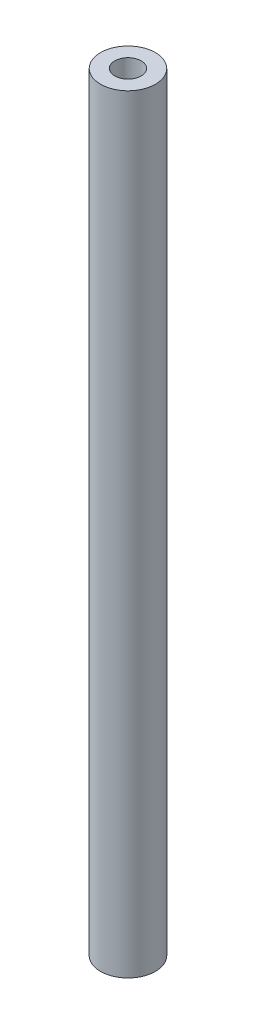
ISO-10303-21;
HEADER;
FILE_DESCRIPTION(('STEP AP214'),'2;1');
FILE_NAME('part.step','',(''),(''),'','','');
FILE_SCHEMA(('AUTOMOTIVE_DESIGN { 1 0 10303 214 1 1 1 1 }'));
ENDSEC;
DATA;
#1=APPLICATION_CONTEXT('core data for automotive mechanical design processes');
#2=APPLICATION_PROTOCOL_DEFINITION('international standard','automotive_design',2000,#1);
#3=PRODUCT_CONTEXT('',#1,'mechanical');
#4=PRODUCT('Part','Part','',(#3));
#5=PRODUCT_RELATED_PRODUCT_CATEGORY('part','',(#4));
#6=PRODUCT_DEFINITION_FORMATION('','',#4);
#7=PRODUCT_DEFINITION_CONTEXT('part definition',#1,'design');
#8=PRODUCT_DEFINITION('design','',#6,#7);
#9=PRODUCT_DEFINITION_SHAPE('','',#8);
#10=(LENGTH_UNIT() NAMED_UNIT(*) SI_UNIT(.MILLI.,.METRE.));
#11=(NAMED_UNIT(*) PLANE_ANGLE_UNIT() SI_UNIT($,.RADIAN.));
#12=(NAMED_UNIT(*) SI_UNIT($,.STERADIAN.) SOLID_ANGLE_UNIT());
#13=UNCERTAINTY_MEASURE_WITH_UNIT(LENGTH_MEASURE(1.E-05),#10,'distance_accuracy_value','');
#14=(GEOMETRIC_REPRESENTATION_CONTEXT(3) GLOBAL_UNCERTAINTY_ASSIGNED_CONTEXT((#13)) GLOBAL_UNIT_ASSIGNED_CONTEXT((#10,
#11,#12)) REPRESENTATION_CONTEXT('',''));
#15=CARTESIAN_POINT('',(0.,0.,0.));
#16=DIRECTION('',(0.,0.,1.));
#17=DIRECTION('',(1.,0.,0.));
#18=AXIS2_PLACEMENT_3D('',#15,#16,#17);
#19=CARTESIAN_POINT('',(0.,88.9,0.));
#20=DIRECTION('',(0.,1.,0.));
#21=DIRECTION('',(0.,0.,1.));
#22=AXIS2_PLACEMENT_3D('',#19,#20,#21);
#23=PLANE('',#22);
#24=CARTESIAN_POINT('',(0.,88.9,0.));
#25=DIRECTION('',(0.,1.,0.));
#26=DIRECTION('',(0.,0.,1.));
#27=AXIS2_PLACEMENT_3D('',#24,#25,#26);
#28=CIRCLE('',#27,3.175);
#29=CARTESIAN_POINT('',(0.,88.9,3.175));
#30=VERTEX_POINT('',#29);
#31=EDGE_CURVE('E10',#30,#30,#28,.T.);
#32=ORIENTED_EDGE('',*,*,#31,.T.);
#33=EDGE_LOOP('',(#32));
#34=FACE_BOUND('',#33,.T.);
#35=CARTESIAN_POINT('',(0.,88.9,0.));
#36=DIRECTION('',(0.,1.,0.));
#37=DIRECTION('',(0.,0.,1.));
#38=AXIS2_PLACEMENT_3D('',#35,#36,#37);
#39=CIRCLE('',#38,1.524);
#40=CARTESIAN_POINT('',(0.,88.9,1.524));
#41=VERTEX_POINT('',#40);
#42=EDGE_CURVE('E47',#41,#41,#39,.T.);
#43=ORIENTED_EDGE('',*,*,#42,.F.);
#44=EDGE_LOOP('',(#43));
#45=FACE_BOUND('',#44,.T.);
#46=ADVANCED_FACE('F36',(#34,#45),#23,.T.);
#47=CARTESIAN_POINT('',(0.,0.,0.));
#48=DIRECTION('',(0.,1.,0.));
#49=DIRECTION('',(0.,0.,1.));
#50=AXIS2_PLACEMENT_3D('',#47,#48,#49);
#51=PLANE('',#50);
#52=CARTESIAN_POINT('',(0.,0.,0.));
#53=DIRECTION('',(0.,1.,0.));
#54=DIRECTION('',(0.,0.,1.));
#55=AXIS2_PLACEMENT_3D('',#52,#53,#54);
#56=CIRCLE('',#55,3.175);
#57=CARTESIAN_POINT('',(0.,0.,3.175));
#58=VERTEX_POINT('',#57);
#59=EDGE_CURVE('E40',#58,#58,#56,.T.);
#60=ORIENTED_EDGE('',*,*,#59,.F.);
#61=EDGE_LOOP('',(#60));
#62=FACE_BOUND('',#61,.T.);
#63=CARTESIAN_POINT('',(0.,0.,0.));
#64=DIRECTION('',(0.,1.,0.));
#65=DIRECTION('',(0.,0.,1.));
#66=AXIS2_PLACEMENT_3D('',#63,#64,#65);
#67=CIRCLE('',#66,1.524);
#68=CARTESIAN_POINT('',(0.,0.,1.524));
#69=VERTEX_POINT('',#68);
#70=EDGE_CURVE('E49',#69,#69,#67,.T.);
#71=ORIENTED_EDGE('',*,*,#70,.T.);
#72=EDGE_LOOP('',(#71));
#73=FACE_BOUND('',#72,.T.);
#74=ADVANCED_FACE('F59',(#62,#73),#51,.F.);
#75=CARTESIAN_POINT('',(0.,88.9,0.));
#76=DIRECTION('',(0.,-1.,0.));
#77=DIRECTION('',(0.,0.,-1.));
#78=AXIS2_PLACEMENT_3D('',#75,#76,#77);
#79=CYLINDRICAL_SURFACE('',#78,3.175);
#80=ORIENTED_EDGE('',*,*,#31,.F.);
#81=EDGE_LOOP('',(#80));
#82=FACE_BOUND('',#81,.T.);
#83=ORIENTED_EDGE('',*,*,#59,.T.);
#84=EDGE_LOOP('',(#83));
#85=FACE_BOUND('',#84,.T.);
#86=ADVANCED_FACE('F38',(#82,#85),#79,.T.);
#87=CARTESIAN_POINT('',(0.,88.9,0.));
#88=DIRECTION('',(0.,-1.,0.));
#89=DIRECTION('',(0.,0.,-1.));
#90=AXIS2_PLACEMENT_3D('',#87,#88,#89);
#91=CYLINDRICAL_SURFACE('',#90,1.524);
#92=ORIENTED_EDGE('',*,*,#42,.T.);
#93=EDGE_LOOP('',(#92));
#94=FACE_BOUND('',#93,.T.);
#95=ORIENTED_EDGE('',*,*,#70,.F.);
#96=EDGE_LOOP('',(#95));
#97=FACE_BOUND('',#96,.T.);
#98=ADVANCED_FACE('F55',(#94,#97),#91,.F.);
#99=CLOSED_SHELL('',(#46,#74,#86,#98));
#100=MANIFOLD_SOLID_BREP('B2',#99);
#101=ADVANCED_BREP_SHAPE_REPRESENTATION('',(#18,#100),#14);
#102=SHAPE_DEFINITION_REPRESENTATION(#9,#101);
ENDSEC;
END-ISO-10303-21;
